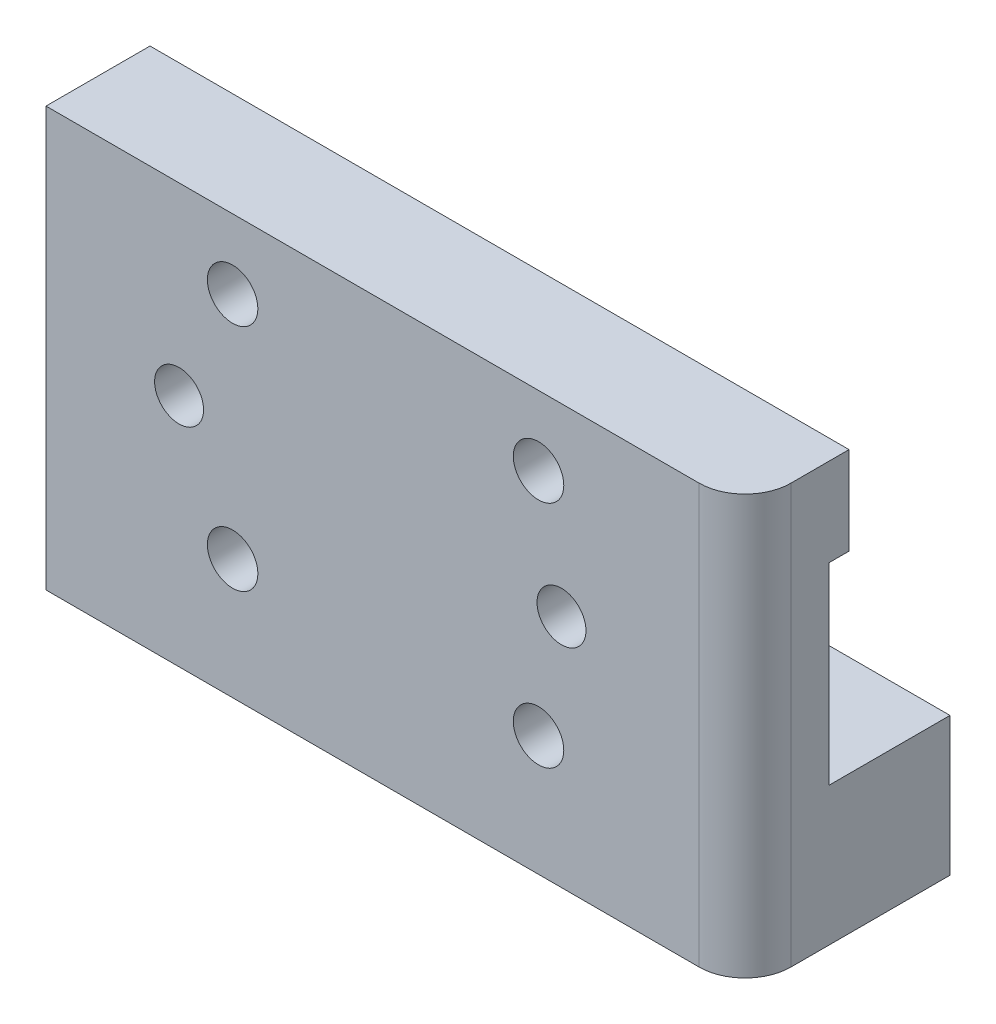
ISO-10303-21;
HEADER;
FILE_DESCRIPTION(('STEP AP214'),'2;1');
FILE_NAME('part.step','',(''),(''),'','','');
FILE_SCHEMA(('AUTOMOTIVE_DESIGN { 1 0 10303 214 1 1 1 1 }'));
ENDSEC;
DATA;
#1=APPLICATION_CONTEXT('core data for automotive mechanical design processes');
#2=APPLICATION_PROTOCOL_DEFINITION('international standard','automotive_design',2000,#1);
#3=PRODUCT_CONTEXT('',#1,'mechanical');
#4=PRODUCT('Part','Part','',(#3));
#5=PRODUCT_RELATED_PRODUCT_CATEGORY('part','',(#4));
#6=PRODUCT_DEFINITION_FORMATION('','',#4);
#7=PRODUCT_DEFINITION_CONTEXT('part definition',#1,'design');
#8=PRODUCT_DEFINITION('design','',#6,#7);
#9=PRODUCT_DEFINITION_SHAPE('','',#8);
#10=(LENGTH_UNIT() NAMED_UNIT(*) SI_UNIT(.MILLI.,.METRE.));
#11=(NAMED_UNIT(*) PLANE_ANGLE_UNIT() SI_UNIT($,.RADIAN.));
#12=(NAMED_UNIT(*) SI_UNIT($,.STERADIAN.) SOLID_ANGLE_UNIT());
#13=UNCERTAINTY_MEASURE_WITH_UNIT(LENGTH_MEASURE(1.E-05),#10,'distance_accuracy_value','');
#14=(GEOMETRIC_REPRESENTATION_CONTEXT(3) GLOBAL_UNCERTAINTY_ASSIGNED_CONTEXT((#13)) GLOBAL_UNIT_ASSIGNED_CONTEXT((#10,
#11,#12)) REPRESENTATION_CONTEXT('',''));
#15=CARTESIAN_POINT('',(0.,0.,0.));
#16=DIRECTION('',(0.,0.,1.));
#17=DIRECTION('',(1.,0.,0.));
#18=AXIS2_PLACEMENT_3D('',#15,#16,#17);
#19=CARTESIAN_POINT('',(-73.1500000000054,-7.84999999999656,1.4));
#20=DIRECTION('',(0.,0.,-1.));
#21=DIRECTION('',(-1.,0.,0.));
#22=AXIS2_PLACEMENT_3D('',#19,#20,#21);
#23=CYLINDRICAL_SURFACE('',#22,1.6499999999999);
#24=CARTESIAN_POINT('',(-73.1500000000054,-7.84999999999656,0.1));
#25=DIRECTION('',(0.,0.,1.));
#26=DIRECTION('',(1.,0.,0.));
#27=AXIS2_PLACEMENT_3D('',#24,#25,#26);
#28=CIRCLE('',#27,1.6499999999999);
#29=CARTESIAN_POINT('',(-72.0175248347155,-9.04999999999708,0.1));
#30=VERTEX_POINT('',#29);
#31=CARTESIAN_POINT('',(-74.2824751652953,-9.04999999999708,0.1));
#32=VERTEX_POINT('',#31);
#33=EDGE_CURVE('E259',#30,#32,#28,.T.);
#34=ORIENTED_EDGE('',*,*,#33,.F.);
#35=DIRECTION('',(0.,0.,-1.));
#36=VECTOR('',#35,1.);
#37=CARTESIAN_POINT('',(-72.0175248347155,-9.04999999999708,1.4));
#38=LINE('',#37,#36);
#39=CARTESIAN_POINT('',(-72.0175248347155,-9.04999999999708,1.4));
#40=VERTEX_POINT('',#39);
#41=EDGE_CURVE('E298',#40,#30,#38,.T.);
#42=ORIENTED_EDGE('',*,*,#41,.F.);
#43=CARTESIAN_POINT('',(-73.1500000000054,-7.84999999999656,1.4));
#44=DIRECTION('',(0.,0.,1.));
#45=DIRECTION('',(1.,0.,0.));
#46=AXIS2_PLACEMENT_3D('',#43,#44,#45);
#47=CIRCLE('',#46,1.6499999999999);
#48=CARTESIAN_POINT('',(-74.2824751652953,-9.04999999999708,1.4));
#49=VERTEX_POINT('',#48);
#50=EDGE_CURVE('E229',#49,#40,#47,.T.);
#51=ORIENTED_EDGE('',*,*,#50,.F.);
#52=DIRECTION('',(0.,0.,-1.));
#53=VECTOR('',#52,1.);
#54=CARTESIAN_POINT('',(-74.2824751652953,-9.04999999999708,1.4));
#55=LINE('',#54,#53);
#56=EDGE_CURVE('E283',#49,#32,#55,.T.);
#57=ORIENTED_EDGE('',*,*,#56,.T.);
#58=EDGE_LOOP('',(#34,#42,#51,#57));
#59=FACE_BOUND('',#58,.T.);
#60=CARTESIAN_POINT('',(-73.1500000000054,-7.84999999999656,6.9));
#61=DIRECTION('',(0.,0.,1.));
#62=DIRECTION('',(1.,0.,0.));
#63=AXIS2_PLACEMENT_3D('',#60,#61,#62);
#64=CIRCLE('',#63,1.6499999999999);
#65=CARTESIAN_POINT('',(-71.5000000000055,-7.84999999999656,6.9));
#66=VERTEX_POINT('',#65);
#67=EDGE_CURVE('E231',#66,#66,#64,.T.);
#68=ORIENTED_EDGE('',*,*,#67,.T.);
#69=EDGE_LOOP('',(#68));
#70=FACE_BOUND('',#69,.T.);
#71=ADVANCED_FACE('F38',(#59,#70),#23,.F.);
#72=CARTESIAN_POINT('',(0.,-9.04999999999708,1.4));
#73=DIRECTION('',(0.,1.,0.));
#74=DIRECTION('',(-1.,0.,0.));
#75=AXIS2_PLACEMENT_3D('',#72,#73,#74);
#76=PLANE('',#75);
#77=DIRECTION('',(1.,0.,0.));
#78=VECTOR('',#77,1.);
#79=CARTESIAN_POINT('',(0.,-9.04999999999708,0.1));
#80=LINE('',#79,#78);
#81=CARTESIAN_POINT('',(-59.6500000000066,-9.04999999999708,0.1));
#82=VERTEX_POINT('',#81);
#83=EDGE_CURVE('E268',#30,#82,#80,.T.);
#84=ORIENTED_EDGE('',*,*,#83,.T.);
#85=DIRECTION('',(0.,0.,-1.));
#86=VECTOR('',#85,1.);
#87=CARTESIAN_POINT('',(-59.6500000000066,-9.04999999999708,1.4));
#88=LINE('',#87,#86);
#89=CARTESIAN_POINT('',(-59.6500000000066,-9.04999999999708,1.4));
#90=VERTEX_POINT('',#89);
#91=EDGE_CURVE('E295',#90,#82,#88,.T.);
#92=ORIENTED_EDGE('',*,*,#91,.F.);
#93=DIRECTION('',(1.,0.,0.));
#94=VECTOR('',#93,1.);
#95=CARTESIAN_POINT('',(0.,-9.04999999999708,1.4));
#96=LINE('',#95,#94);
#97=EDGE_CURVE('E260',#40,#90,#96,.T.);
#98=ORIENTED_EDGE('',*,*,#97,.F.);
#99=ORIENTED_EDGE('',*,*,#41,.T.);
#100=EDGE_LOOP('',(#84,#92,#98,#99));
#101=FACE_BOUND('',#100,.T.);
#102=ADVANCED_FACE('F329',(#101),#76,.F.);
#103=CARTESIAN_POINT('',(-59.6500000000065,3.59917409885632E-13,1.4));
#104=DIRECTION('',(-1.,0.,0.));
#105=DIRECTION('',(0.,-1.,0.));
#106=AXIS2_PLACEMENT_3D('',#103,#104,#105);
#107=PLANE('',#106);
#108=DIRECTION('',(0.,0.,-1.));
#109=VECTOR('',#108,1.);
#110=CARTESIAN_POINT('',(-59.6500000000066,-3.30000000000215,1.4));
#111=LINE('',#110,#109);
#112=CARTESIAN_POINT('',(-59.6500000000066,-3.30000000000215,3.9));
#113=VERTEX_POINT('',#112);
#114=CARTESIAN_POINT('',(-59.6500000000066,-3.30000000000215,0.1));
#115=VERTEX_POINT('',#114);
#116=EDGE_CURVE('E293',#113,#115,#111,.T.);
#117=ORIENTED_EDGE('',*,*,#116,.F.);
#118=DIRECTION('',(0.,1.,0.));
#119=VECTOR('',#118,1.);
#120=CARTESIAN_POINT('',(-59.6500000000067,-30.7000000000023,3.9));
#121=LINE('',#120,#119);
#122=CARTESIAN_POINT('',(-59.6500000000064,-30.7000000000023,3.9));
#123=VERTEX_POINT('',#122);
#124=EDGE_CURVE('E46',#113,#123,#121,.F.);
#125=ORIENTED_EDGE('',*,*,#124,.T.);
#126=DIRECTION('',(0.,0.,-1.));
#127=VECTOR('',#126,1.);
#128=CARTESIAN_POINT('',(-59.6500000000064,-30.7000000000023,6.9));
#129=LINE('',#128,#127);
#130=CARTESIAN_POINT('',(-59.6500000000064,-30.7000000000023,-6.49999999999786));
#131=VERTEX_POINT('',#130);
#132=EDGE_CURVE('E252',#123,#131,#129,.T.);
#133=ORIENTED_EDGE('',*,*,#132,.T.);
#134=DIRECTION('',(0.,1.,0.));
#135=VECTOR('',#134,1.);
#136=CARTESIAN_POINT('',(-59.6500000000064,0.,-6.49999999999786));
#137=LINE('',#136,#135);
#138=CARTESIAN_POINT('',(-59.6500000000064,-21.6499999999971,-6.49999999999786));
#139=VERTEX_POINT('',#138);
#140=EDGE_CURVE('E195',#131,#139,#137,.T.);
#141=ORIENTED_EDGE('',*,*,#140,.T.);
#142=DIRECTION('',(0.,0.,-1.));
#143=VECTOR('',#142,1.);
#144=CARTESIAN_POINT('',(-59.6500000000064,-21.6499999999971,1.4));
#145=LINE('',#144,#143);
#146=CARTESIAN_POINT('',(-59.6500000000064,-21.6499999999971,1.4));
#147=VERTEX_POINT('',#146);
#148=EDGE_CURVE('E203',#147,#139,#145,.T.);
#149=ORIENTED_EDGE('',*,*,#148,.F.);
#150=DIRECTION('',(0.,1.,0.));
#151=VECTOR('',#150,1.);
#152=CARTESIAN_POINT('',(-59.6500000000064,-3.30000000000215,1.4));
#153=LINE('',#152,#151);
#154=EDGE_CURVE('E247',#147,#90,#153,.T.);
#155=ORIENTED_EDGE('',*,*,#154,.T.);
#156=ORIENTED_EDGE('',*,*,#91,.T.);
#157=DIRECTION('',(0.,1.,0.));
#158=VECTOR('',#157,1.);
#159=CARTESIAN_POINT('',(-59.6500000000065,3.59917409885632E-13,0.1));
#160=LINE('',#159,#158);
#161=EDGE_CURVE('E270',#82,#115,#160,.T.);
#162=ORIENTED_EDGE('',*,*,#161,.T.);
#163=EDGE_LOOP('',(#117,#125,#133,#141,#149,#155,#156,#162));
#164=FACE_BOUND('',#163,.T.);
#165=ADVANCED_FACE('F334',(#164),#107,.F.);
#166=CARTESIAN_POINT('',(0.,-3.30000000000215,1.4));
#167=DIRECTION('',(0.,1.,0.));
#168=DIRECTION('',(-1.,0.,0.));
#169=AXIS2_PLACEMENT_3D('',#166,#167,#168);
#170=PLANE('',#169);
#171=DIRECTION('',(-1.,0.,0.));
#172=VECTOR('',#171,1.);
#173=CARTESIAN_POINT('',(-105.350000000007,-3.30000000000215,6.9));
#174=LINE('',#173,#172);
#175=CARTESIAN_POINT('',(-62.6500000000066,-3.30000000000215,6.9));
#176=VERTEX_POINT('',#175);
#177=CARTESIAN_POINT('',(-105.350000000007,-3.30000000000215,6.9));
#178=VERTEX_POINT('',#177);
#179=EDGE_CURVE('E250',#176,#178,#174,.T.);
#180=ORIENTED_EDGE('',*,*,#179,.F.);
#181=CARTESIAN_POINT('',(-62.6500000000066,-3.30000000000215,3.9));
#182=DIRECTION('',(0.,1.,0.));
#183=DIRECTION('',(-1.,0.,0.));
#184=AXIS2_PLACEMENT_3D('',#181,#182,#183);
#185=CIRCLE('',#184,3.);
#186=EDGE_CURVE('E60',#176,#113,#185,.T.);
#187=ORIENTED_EDGE('',*,*,#186,.T.);
#188=ORIENTED_EDGE('',*,*,#116,.T.);
#189=DIRECTION('',(1.,0.,0.));
#190=VECTOR('',#189,1.);
#191=CARTESIAN_POINT('',(0.,-3.30000000000215,0.1));
#192=LINE('',#191,#190);
#193=CARTESIAN_POINT('',(-105.350000000007,-3.30000000000215,0.1));
#194=VERTEX_POINT('',#193);
#195=EDGE_CURVE('E274',#194,#115,#192,.T.);
#196=ORIENTED_EDGE('',*,*,#195,.F.);
#197=DIRECTION('',(0.,0.,-1.));
#198=VECTOR('',#197,1.);
#199=CARTESIAN_POINT('',(-105.350000000007,-3.30000000000215,1.4));
#200=LINE('',#199,#198);
#201=EDGE_CURVE('E291',#178,#194,#200,.T.);
#202=ORIENTED_EDGE('',*,*,#201,.F.);
#203=EDGE_LOOP('',(#180,#187,#188,#196,#202));
#204=FACE_BOUND('',#203,.T.);
#205=ADVANCED_FACE('F310',(#204),#170,.T.);
#206=CARTESIAN_POINT('',(-105.350000000007,0.,1.4));
#207=DIRECTION('',(-1.,0.,0.));
#208=DIRECTION('',(0.,0.,1.));
#209=AXIS2_PLACEMENT_3D('',#206,#207,#208);
#210=PLANE('',#209);
#211=DIRECTION('',(0.,1.,0.));
#212=VECTOR('',#211,1.);
#213=CARTESIAN_POINT('',(-105.350000000007,0.,0.1));
#214=LINE('',#213,#212);
#215=CARTESIAN_POINT('',(-105.350000000007,-9.04999999999708,0.1));
#216=VERTEX_POINT('',#215);
#217=EDGE_CURVE('E277',#216,#194,#214,.T.);
#218=ORIENTED_EDGE('',*,*,#217,.F.);
#219=DIRECTION('',(0.,0.,-1.));
#220=VECTOR('',#219,1.);
#221=CARTESIAN_POINT('',(-105.350000000007,-9.04999999999708,1.4));
#222=LINE('',#221,#220);
#223=CARTESIAN_POINT('',(-105.350000000007,-9.04999999999708,1.4));
#224=VERTEX_POINT('',#223);
#225=EDGE_CURVE('E289',#224,#216,#222,.T.);
#226=ORIENTED_EDGE('',*,*,#225,.F.);
#227=DIRECTION('',(0.,-1.,0.));
#228=VECTOR('',#227,1.);
#229=CARTESIAN_POINT('',(-105.350000000007,-3.30000000000215,1.4));
#230=LINE('',#229,#228);
#231=CARTESIAN_POINT('',(-105.350000000007,-21.6499999999971,1.4));
#232=VERTEX_POINT('',#231);
#233=EDGE_CURVE('E240',#224,#232,#230,.T.);
#234=ORIENTED_EDGE('',*,*,#233,.T.);
#235=DIRECTION('',(0.,0.,-1.));
#236=VECTOR('',#235,1.);
#237=CARTESIAN_POINT('',(-105.350000000007,-21.6499999999971,1.4));
#238=LINE('',#237,#236);
#239=CARTESIAN_POINT('',(-105.350000000007,-21.6499999999971,-6.49999999999786));
#240=VERTEX_POINT('',#239);
#241=EDGE_CURVE('E205',#232,#240,#238,.T.);
#242=ORIENTED_EDGE('',*,*,#241,.T.);
#243=DIRECTION('',(0.,1.,0.));
#244=VECTOR('',#243,1.);
#245=CARTESIAN_POINT('',(-105.350000000007,0.,-6.49999999999786));
#246=LINE('',#245,#244);
#247=CARTESIAN_POINT('',(-105.350000000007,-30.7000000000023,-6.49999999999786));
#248=VERTEX_POINT('',#247);
#249=EDGE_CURVE('E188',#248,#240,#246,.T.);
#250=ORIENTED_EDGE('',*,*,#249,.F.);
#251=DIRECTION('',(0.,0.,-1.));
#252=VECTOR('',#251,1.);
#253=CARTESIAN_POINT('',(-105.350000000007,-30.7000000000023,6.9));
#254=LINE('',#253,#252);
#255=CARTESIAN_POINT('',(-105.350000000007,-30.7000000000023,6.9));
#256=VERTEX_POINT('',#255);
#257=EDGE_CURVE('E257',#256,#248,#254,.T.);
#258=ORIENTED_EDGE('',*,*,#257,.F.);
#259=DIRECTION('',(0.,-1.,0.));
#260=VECTOR('',#259,1.);
#261=CARTESIAN_POINT('',(-105.350000000007,-3.30000000000215,6.9));
#262=LINE('',#261,#260);
#263=EDGE_CURVE('E243',#178,#256,#262,.T.);
#264=ORIENTED_EDGE('',*,*,#263,.F.);
#265=ORIENTED_EDGE('',*,*,#201,.T.);
#266=EDGE_LOOP('',(#218,#226,#234,#242,#250,#258,#264,#265));
#267=FACE_BOUND('',#266,.T.);
#268=ADVANCED_FACE('F316',(#267),#210,.T.);
#269=CARTESIAN_POINT('',(-94.2824751652872,-9.04999999999708,0.1));
#270=VERTEX_POINT('',#269);
#271=EDGE_CURVE('E271',#216,#270,#80,.T.);
#272=ORIENTED_EDGE('',*,*,#271,.T.);
#273=DIRECTION('',(0.,0.,-1.));
#274=VECTOR('',#273,1.);
#275=CARTESIAN_POINT('',(-94.2824751652872,-9.04999999999708,1.4));
#276=LINE('',#275,#274);
#277=CARTESIAN_POINT('',(-94.2824751652872,-9.04999999999708,1.4));
#278=VERTEX_POINT('',#277);
#279=EDGE_CURVE('E287',#278,#270,#276,.T.);
#280=ORIENTED_EDGE('',*,*,#279,.F.);
#281=EDGE_CURVE('E263',#224,#278,#96,.T.);
#282=ORIENTED_EDGE('',*,*,#281,.F.);
#283=ORIENTED_EDGE('',*,*,#225,.T.);
#284=EDGE_LOOP('',(#272,#280,#282,#283));
#285=FACE_BOUND('',#284,.T.);
#286=ADVANCED_FACE('F337',(#285),#76,.F.);
#287=CARTESIAN_POINT('',(-93.1500000000054,-7.84999999999657,1.4));
#288=DIRECTION('',(0.,0.,-1.));
#289=DIRECTION('',(-1.,0.,0.));
#290=AXIS2_PLACEMENT_3D('',#287,#288,#289);
#291=CYLINDRICAL_SURFACE('',#290,1.64999999999434);
#292=CARTESIAN_POINT('',(-93.1500000000054,-7.84999999999657,0.1));
#293=DIRECTION('',(0.,0.,1.));
#294=DIRECTION('',(1.,0.,0.));
#295=AXIS2_PLACEMENT_3D('',#292,#293,#294);
#296=CIRCLE('',#295,1.64999999999434);
#297=CARTESIAN_POINT('',(-92.0175248347236,-9.04999999999708,0.1));
#298=VERTEX_POINT('',#297);
#299=EDGE_CURVE('E280',#298,#270,#296,.T.);
#300=ORIENTED_EDGE('',*,*,#299,.F.);
#301=DIRECTION('',(0.,0.,-1.));
#302=VECTOR('',#301,1.);
#303=CARTESIAN_POINT('',(-92.0175248347236,-9.04999999999708,1.4));
#304=LINE('',#303,#302);
#305=CARTESIAN_POINT('',(-92.0175248347236,-9.04999999999708,1.4));
#306=VERTEX_POINT('',#305);
#307=EDGE_CURVE('E285',#306,#298,#304,.T.);
#308=ORIENTED_EDGE('',*,*,#307,.F.);
#309=CARTESIAN_POINT('',(-93.1500000000054,-7.84999999999657,1.4));
#310=DIRECTION('',(0.,0.,1.));
#311=DIRECTION('',(1.,0.,0.));
#312=AXIS2_PLACEMENT_3D('',#309,#310,#311);
#313=CIRCLE('',#312,1.64999999999434);
#314=EDGE_CURVE('E234',#278,#306,#313,.T.);
#315=ORIENTED_EDGE('',*,*,#314,.F.);
#316=ORIENTED_EDGE('',*,*,#279,.T.);
#317=EDGE_LOOP('',(#300,#308,#315,#316));
#318=FACE_BOUND('',#317,.T.);
#319=CARTESIAN_POINT('',(-93.1500000000054,-7.84999999999657,6.9));
#320=DIRECTION('',(0.,0.,1.));
#321=DIRECTION('',(1.,0.,0.));
#322=AXIS2_PLACEMENT_3D('',#319,#320,#321);
#323=CIRCLE('',#322,1.64999999999434);
#324=CARTESIAN_POINT('',(-91.5000000000111,-7.84999999999657,6.9));
#325=VERTEX_POINT('',#324);
#326=EDGE_CURVE('E237',#325,#325,#323,.T.);
#327=ORIENTED_EDGE('',*,*,#326,.T.);
#328=EDGE_LOOP('',(#327));
#329=FACE_BOUND('',#328,.T.);
#330=ADVANCED_FACE('F348',(#318,#329),#291,.F.);
#331=EDGE_CURVE('E264',#298,#32,#80,.T.);
#332=ORIENTED_EDGE('',*,*,#331,.T.);
#333=ORIENTED_EDGE('',*,*,#56,.F.);
#334=EDGE_CURVE('E265',#306,#49,#96,.T.);
#335=ORIENTED_EDGE('',*,*,#334,.F.);
#336=ORIENTED_EDGE('',*,*,#307,.T.);
#337=EDGE_LOOP('',(#332,#333,#335,#336));
#338=FACE_BOUND('',#337,.T.);
#339=ADVANCED_FACE('F338',(#338),#76,.F.);
#340=CARTESIAN_POINT('',(0.,0.,0.1));
#341=DIRECTION('',(0.,0.,1.));
#342=DIRECTION('',(1.,0.,0.));
#343=AXIS2_PLACEMENT_3D('',#340,#341,#342);
#344=PLANE('',#343);
#345=ORIENTED_EDGE('',*,*,#33,.T.);
#346=ORIENTED_EDGE('',*,*,#331,.F.);
#347=ORIENTED_EDGE('',*,*,#299,.T.);
#348=ORIENTED_EDGE('',*,*,#271,.F.);
#349=ORIENTED_EDGE('',*,*,#217,.T.);
#350=ORIENTED_EDGE('',*,*,#195,.T.);
#351=ORIENTED_EDGE('',*,*,#161,.F.);
#352=ORIENTED_EDGE('',*,*,#83,.F.);
#353=EDGE_LOOP('',(#345,#346,#347,#348,#349,#350,#351,#352));
#354=FACE_BOUND('',#353,.T.);
#355=ADVANCED_FACE('F353',(#354),#344,.F.);
#356=CARTESIAN_POINT('',(0.,0.,1.4));
#357=DIRECTION('',(0.,0.,1.));
#358=DIRECTION('',(1.,0.,0.));
#359=AXIS2_PLACEMENT_3D('',#356,#357,#358);
#360=PLANE('',#359);
#361=CARTESIAN_POINT('',(-73.1500000000063,-22.8499864669187,1.4));
#362=DIRECTION('',(0.,0.,1.));
#363=DIRECTION('',(1.,0.,0.));
#364=AXIS2_PLACEMENT_3D('',#361,#362,#363);
#365=CIRCLE('',#364,1.65);
#366=CARTESIAN_POINT('',(-72.0175104948872,-21.6499999999971,1.4));
#367=VERTEX_POINT('',#366);
#368=CARTESIAN_POINT('',(-74.2824895051254,-21.6499999999971,1.4));
#369=VERTEX_POINT('',#368);
#370=EDGE_CURVE('E219',#367,#369,#365,.T.);
#371=ORIENTED_EDGE('',*,*,#370,.T.);
#372=DIRECTION('',(1.,0.,0.));
#373=VECTOR('',#372,1.);
#374=CARTESIAN_POINT('',(0.,-21.6499999999971,1.4));
#375=LINE('',#374,#373);
#376=CARTESIAN_POINT('',(-92.01751049489,-21.6499999999971,1.4));
#377=VERTEX_POINT('',#376);
#378=EDGE_CURVE('E183',#377,#369,#375,.T.);
#379=ORIENTED_EDGE('',*,*,#378,.F.);
#380=CARTESIAN_POINT('',(-93.1500000000089,-22.8499864669189,1.4));
#381=DIRECTION('',(0.,0.,1.));
#382=DIRECTION('',(1.,0.,0.));
#383=AXIS2_PLACEMENT_3D('',#380,#381,#382);
#384=CIRCLE('',#383,1.65);
#385=CARTESIAN_POINT('',(-94.2824895051278,-21.6499999999971,1.4));
#386=VERTEX_POINT('',#385);
#387=EDGE_CURVE('E163',#377,#386,#384,.T.);
#388=ORIENTED_EDGE('',*,*,#387,.T.);
#389=EDGE_CURVE('E185',#232,#386,#375,.T.);
#390=ORIENTED_EDGE('',*,*,#389,.F.);
#391=ORIENTED_EDGE('',*,*,#233,.F.);
#392=ORIENTED_EDGE('',*,*,#281,.T.);
#393=ORIENTED_EDGE('',*,*,#314,.T.);
#394=ORIENTED_EDGE('',*,*,#334,.T.);
#395=ORIENTED_EDGE('',*,*,#50,.T.);
#396=ORIENTED_EDGE('',*,*,#97,.T.);
#397=ORIENTED_EDGE('',*,*,#154,.F.);
#398=EDGE_CURVE('E187',#367,#147,#375,.T.);
#399=ORIENTED_EDGE('',*,*,#398,.F.);
#400=EDGE_LOOP('',(#371,#379,#388,#390,#391,#392,#393,#394,#395,#396,#397,#399));
#401=FACE_BOUND('',#400,.T.);
#402=CARTESIAN_POINT('',(-96.6500000000586,-15.3499999999947,1.4));
#403=DIRECTION('',(0.,0.,1.));
#404=DIRECTION('',(1.,0.,0.));
#405=AXIS2_PLACEMENT_3D('',#402,#403,#404);
#406=CIRCLE('',#405,1.60000000000178);
#407=CARTESIAN_POINT('',(-95.0500000000568,-15.3499999999947,1.4));
#408=VERTEX_POINT('',#407);
#409=EDGE_CURVE('E213',#408,#408,#406,.T.);
#410=ORIENTED_EDGE('',*,*,#409,.T.);
#411=EDGE_LOOP('',(#410));
#412=FACE_BOUND('',#411,.T.);
#413=CARTESIAN_POINT('',(-71.6500000000585,-15.3499999999947,1.4));
#414=DIRECTION('',(0.,0.,1.));
#415=DIRECTION('',(1.,0.,0.));
#416=AXIS2_PLACEMENT_3D('',#413,#414,#415);
#417=CIRCLE('',#416,1.60000000000178);
#418=CARTESIAN_POINT('',(-70.0500000000567,-15.3499999999947,1.4));
#419=VERTEX_POINT('',#418);
#420=EDGE_CURVE('E209',#419,#419,#417,.T.);
#421=ORIENTED_EDGE('',*,*,#420,.T.);
#422=EDGE_LOOP('',(#421));
#423=FACE_BOUND('',#422,.T.);
#424=ADVANCED_FACE('F357',(#401,#412,#423),#360,.F.);
#425=CARTESIAN_POINT('',(0.,0.,6.9));
#426=DIRECTION('',(0.,0.,1.));
#427=DIRECTION('',(1.,0.,0.));
#428=AXIS2_PLACEMENT_3D('',#425,#426,#427);
#429=PLANE('',#428);
#430=CARTESIAN_POINT('',(-96.6500000000586,-15.3499999999947,6.9));
#431=DIRECTION('',(0.,0.,1.));
#432=DIRECTION('',(1.,0.,0.));
#433=AXIS2_PLACEMENT_3D('',#430,#431,#432);
#434=CIRCLE('',#433,1.60000000000178);
#435=CARTESIAN_POINT('',(-95.0500000000568,-15.3499999999947,6.9));
#436=VERTEX_POINT('',#435);
#437=EDGE_CURVE('E216',#436,#436,#434,.T.);
#438=ORIENTED_EDGE('',*,*,#437,.F.);
#439=EDGE_LOOP('',(#438));
#440=FACE_BOUND('',#439,.T.);
#441=CARTESIAN_POINT('',(-93.1500000000089,-22.8499864669189,6.9));
#442=DIRECTION('',(0.,0.,1.));
#443=DIRECTION('',(1.,0.,0.));
#444=AXIS2_PLACEMENT_3D('',#441,#442,#443);
#445=CIRCLE('',#444,1.65);
#446=CARTESIAN_POINT('',(-91.5000000000089,-22.8499864669189,6.9));
#447=VERTEX_POINT('',#446);
#448=EDGE_CURVE('E226',#447,#447,#445,.T.);
#449=ORIENTED_EDGE('',*,*,#448,.F.);
#450=EDGE_LOOP('',(#449));
#451=FACE_BOUND('',#450,.T.);
#452=ORIENTED_EDGE('',*,*,#326,.F.);
#453=EDGE_LOOP('',(#452));
#454=FACE_BOUND('',#453,.T.);
#455=DIRECTION('',(1.,0.,0.));
#456=VECTOR('',#455,1.);
#457=CARTESIAN_POINT('',(-105.350000000007,-30.7000000000023,6.9));
#458=LINE('',#457,#456);
#459=CARTESIAN_POINT('',(-62.6500000000067,-30.7000000000023,6.9));
#460=VERTEX_POINT('',#459);
#461=EDGE_CURVE('E246',#256,#460,#458,.T.);
#462=ORIENTED_EDGE('',*,*,#461,.T.);
#463=DIRECTION('',(0.,1.,0.));
#464=VECTOR('',#463,1.);
#465=CARTESIAN_POINT('',(-62.6500000000066,-3.30000000000213,6.9));
#466=LINE('',#465,#464);
#467=EDGE_CURVE('E300',#460,#176,#466,.T.);
#468=ORIENTED_EDGE('',*,*,#467,.T.);
#469=ORIENTED_EDGE('',*,*,#179,.T.);
#470=ORIENTED_EDGE('',*,*,#263,.T.);
#471=EDGE_LOOP('',(#462,#468,#469,#470));
#472=FACE_BOUND('',#471,.T.);
#473=ORIENTED_EDGE('',*,*,#67,.F.);
#474=EDGE_LOOP('',(#473));
#475=FACE_BOUND('',#474,.T.);
#476=CARTESIAN_POINT('',(-73.1500000000063,-22.8499864669187,6.9));
#477=DIRECTION('',(0.,0.,1.));
#478=DIRECTION('',(1.,0.,0.));
#479=AXIS2_PLACEMENT_3D('',#476,#477,#478);
#480=CIRCLE('',#479,1.65);
#481=CARTESIAN_POINT('',(-71.5000000000063,-22.8499864669187,6.9));
#482=VERTEX_POINT('',#481);
#483=EDGE_CURVE('E222',#482,#482,#480,.T.);
#484=ORIENTED_EDGE('',*,*,#483,.F.);
#485=EDGE_LOOP('',(#484));
#486=FACE_BOUND('',#485,.T.);
#487=CARTESIAN_POINT('',(-71.6500000000585,-15.3499999999947,6.9));
#488=DIRECTION('',(0.,0.,1.));
#489=DIRECTION('',(1.,0.,0.));
#490=AXIS2_PLACEMENT_3D('',#487,#488,#489);
#491=CIRCLE('',#490,1.60000000000178);
#492=CARTESIAN_POINT('',(-70.0500000000567,-15.3499999999947,6.9));
#493=VERTEX_POINT('',#492);
#494=EDGE_CURVE('E210',#493,#493,#491,.T.);
#495=ORIENTED_EDGE('',*,*,#494,.F.);
#496=EDGE_LOOP('',(#495));
#497=FACE_BOUND('',#496,.T.);
#498=ADVANCED_FACE('F305',(#440,#451,#454,#472,#475,#486,#497),#429,.T.);
#499=CARTESIAN_POINT('',(-105.350000000007,-30.7000000000023,6.9));
#500=DIRECTION('',(0.,1.,0.));
#501=DIRECTION('',(0.,0.,1.));
#502=AXIS2_PLACEMENT_3D('',#499,#500,#501);
#503=PLANE('',#502);
#504=ORIENTED_EDGE('',*,*,#132,.F.);
#505=CARTESIAN_POINT('',(-62.6500000000067,-30.7000000000023,3.9));
#506=DIRECTION('',(0.,1.,0.));
#507=DIRECTION('',(0.,0.,1.));
#508=AXIS2_PLACEMENT_3D('',#505,#506,#507);
#509=CIRCLE('',#508,3.);
#510=EDGE_CURVE('E12',#123,#460,#509,.F.);
#511=ORIENTED_EDGE('',*,*,#510,.T.);
#512=ORIENTED_EDGE('',*,*,#461,.F.);
#513=ORIENTED_EDGE('',*,*,#257,.T.);
#514=DIRECTION('',(1.,0.,0.));
#515=VECTOR('',#514,1.);
#516=CARTESIAN_POINT('',(0.,-30.7000000000023,-6.49999999999786));
#517=LINE('',#516,#515);
#518=EDGE_CURVE('E177',#248,#131,#517,.T.);
#519=ORIENTED_EDGE('',*,*,#518,.T.);
#520=EDGE_LOOP('',(#504,#511,#512,#513,#519));
#521=FACE_BOUND('',#520,.T.);
#522=ADVANCED_FACE('F320',(#521),#503,.F.);
#523=CARTESIAN_POINT('',(-93.1500000000089,-22.8499864669189,6.9));
#524=DIRECTION('',(0.,0.,-1.));
#525=DIRECTION('',(-1.,0.,0.));
#526=AXIS2_PLACEMENT_3D('',#523,#524,#525);
#527=CYLINDRICAL_SURFACE('',#526,1.65);
#528=ORIENTED_EDGE('',*,*,#448,.T.);
#529=EDGE_LOOP('',(#528));
#530=FACE_BOUND('',#529,.T.);
#531=ORIENTED_EDGE('',*,*,#387,.F.);
#532=DIRECTION('',(0.,0.,-1.));
#533=VECTOR('',#532,1.);
#534=CARTESIAN_POINT('',(-92.01751049489,-21.6499999999971,1.4));
#535=LINE('',#534,#533);
#536=CARTESIAN_POINT('',(-92.01751049489,-21.6499999999971,-6.49999999999786));
#537=VERTEX_POINT('',#536);
#538=EDGE_CURVE('E156',#377,#537,#535,.T.);
#539=ORIENTED_EDGE('',*,*,#538,.T.);
#540=CARTESIAN_POINT('',(-93.1500000000089,-22.8499864669189,-6.49999999999786));
#541=DIRECTION('',(0.,0.,-1.));
#542=DIRECTION('',(-1.,0.,0.));
#543=AXIS2_PLACEMENT_3D('',#540,#541,#542);
#544=CIRCLE('',#543,1.65);
#545=CARTESIAN_POINT('',(-94.2824895051278,-21.6499999999971,-6.49999999999786));
#546=VERTEX_POINT('',#545);
#547=EDGE_CURVE('E161',#546,#537,#544,.F.);
#548=ORIENTED_EDGE('',*,*,#547,.F.);
#549=DIRECTION('',(0.,0.,-1.));
#550=VECTOR('',#549,1.);
#551=CARTESIAN_POINT('',(-94.2824895051278,-21.6499999999971,1.4));
#552=LINE('',#551,#550);
#553=EDGE_CURVE('E167',#386,#546,#552,.T.);
#554=ORIENTED_EDGE('',*,*,#553,.F.);
#555=EDGE_LOOP('',(#531,#539,#548,#554));
#556=FACE_BOUND('',#555,.T.);
#557=ADVANCED_FACE('F158',(#530,#556),#527,.F.);
#558=CARTESIAN_POINT('',(-73.1500000000063,-22.8499864669187,6.9));
#559=DIRECTION('',(0.,0.,-1.));
#560=DIRECTION('',(-1.,0.,0.));
#561=AXIS2_PLACEMENT_3D('',#558,#559,#560);
#562=CYLINDRICAL_SURFACE('',#561,1.65);
#563=ORIENTED_EDGE('',*,*,#483,.T.);
#564=EDGE_LOOP('',(#563));
#565=FACE_BOUND('',#564,.T.);
#566=ORIENTED_EDGE('',*,*,#370,.F.);
#567=DIRECTION('',(0.,0.,-1.));
#568=VECTOR('',#567,1.);
#569=CARTESIAN_POINT('',(-72.0175104948872,-21.6499999999971,1.4));
#570=LINE('',#569,#568);
#571=CARTESIAN_POINT('',(-72.0175104948872,-21.6499999999971,-6.49999999999786));
#572=VERTEX_POINT('',#571);
#573=EDGE_CURVE('E201',#367,#572,#570,.T.);
#574=ORIENTED_EDGE('',*,*,#573,.T.);
#575=CARTESIAN_POINT('',(-73.1500000000063,-22.8499864669187,-6.49999999999786));
#576=DIRECTION('',(0.,0.,-1.));
#577=DIRECTION('',(-1.,0.,0.));
#578=AXIS2_PLACEMENT_3D('',#575,#576,#577);
#579=CIRCLE('',#578,1.65);
#580=CARTESIAN_POINT('',(-74.2824895051254,-21.6499999999971,-6.49999999999786));
#581=VERTEX_POINT('',#580);
#582=EDGE_CURVE('E176',#581,#572,#579,.F.);
#583=ORIENTED_EDGE('',*,*,#582,.F.);
#584=DIRECTION('',(0.,0.,-1.));
#585=VECTOR('',#584,1.);
#586=CARTESIAN_POINT('',(-74.2824895051254,-21.6499999999971,1.4));
#587=LINE('',#586,#585);
#588=EDGE_CURVE('E166',#369,#581,#587,.T.);
#589=ORIENTED_EDGE('',*,*,#588,.F.);
#590=EDGE_LOOP('',(#566,#574,#583,#589));
#591=FACE_BOUND('',#590,.T.);
#592=ADVANCED_FACE('F369',(#565,#591),#562,.F.);
#593=CARTESIAN_POINT('',(-96.6500000000586,-15.3499999999947,6.9));
#594=DIRECTION('',(0.,0.,-1.));
#595=DIRECTION('',(-1.,0.,0.));
#596=AXIS2_PLACEMENT_3D('',#593,#594,#595);
#597=CYLINDRICAL_SURFACE('',#596,1.60000000000178);
#598=ORIENTED_EDGE('',*,*,#437,.T.);
#599=EDGE_LOOP('',(#598));
#600=FACE_BOUND('',#599,.T.);
#601=ORIENTED_EDGE('',*,*,#409,.F.);
#602=EDGE_LOOP('',(#601));
#603=FACE_BOUND('',#602,.T.);
#604=ADVANCED_FACE('F373',(#600,#603),#597,.F.);
#605=CARTESIAN_POINT('',(-71.6500000000585,-15.3499999999947,6.9));
#606=DIRECTION('',(0.,0.,-1.));
#607=DIRECTION('',(-1.,0.,0.));
#608=AXIS2_PLACEMENT_3D('',#605,#606,#607);
#609=CYLINDRICAL_SURFACE('',#608,1.60000000000178);
#610=ORIENTED_EDGE('',*,*,#494,.T.);
#611=EDGE_LOOP('',(#610));
#612=FACE_BOUND('',#611,.T.);
#613=ORIENTED_EDGE('',*,*,#420,.F.);
#614=EDGE_LOOP('',(#613));
#615=FACE_BOUND('',#614,.T.);
#616=ADVANCED_FACE('F377',(#612,#615),#609,.F.);
#617=CARTESIAN_POINT('',(0.,-21.6499999999971,1.4));
#618=DIRECTION('',(0.,1.,0.));
#619=DIRECTION('',(0.,0.,1.));
#620=AXIS2_PLACEMENT_3D('',#617,#618,#619);
#621=PLANE('',#620);
#622=ORIENTED_EDGE('',*,*,#588,.T.);
#623=DIRECTION('',(1.,0.,0.));
#624=VECTOR('',#623,1.);
#625=CARTESIAN_POINT('',(0.,-21.6499999999971,-6.49999999999786));
#626=LINE('',#625,#624);
#627=EDGE_CURVE('E170',#537,#581,#626,.T.);
#628=ORIENTED_EDGE('',*,*,#627,.F.);
#629=ORIENTED_EDGE('',*,*,#538,.F.);
#630=ORIENTED_EDGE('',*,*,#378,.T.);
#631=EDGE_LOOP('',(#622,#628,#629,#630));
#632=FACE_BOUND('',#631,.T.);
#633=ADVANCED_FACE('F171',(#632),#621,.T.);
#634=ORIENTED_EDGE('',*,*,#553,.T.);
#635=DIRECTION('',(1.,0.,0.));
#636=VECTOR('',#635,1.);
#637=CARTESIAN_POINT('',(0.,-21.6499999999971,-6.49999999999786));
#638=LINE('',#637,#636);
#639=EDGE_CURVE('E182',#240,#546,#638,.T.);
#640=ORIENTED_EDGE('',*,*,#639,.F.);
#641=ORIENTED_EDGE('',*,*,#241,.F.);
#642=ORIENTED_EDGE('',*,*,#389,.T.);
#643=EDGE_LOOP('',(#634,#640,#641,#642));
#644=FACE_BOUND('',#643,.T.);
#645=ADVANCED_FACE('F383',(#644),#621,.T.);
#646=ORIENTED_EDGE('',*,*,#148,.T.);
#647=DIRECTION('',(1.,0.,0.));
#648=VECTOR('',#647,1.);
#649=CARTESIAN_POINT('',(0.,-21.6499999999971,-6.49999999999786));
#650=LINE('',#649,#648);
#651=EDGE_CURVE('E192',#572,#139,#650,.T.);
#652=ORIENTED_EDGE('',*,*,#651,.F.);
#653=ORIENTED_EDGE('',*,*,#573,.F.);
#654=ORIENTED_EDGE('',*,*,#398,.T.);
#655=EDGE_LOOP('',(#646,#652,#653,#654));
#656=FACE_BOUND('',#655,.T.);
#657=ADVANCED_FACE('F326',(#656),#621,.T.);
#658=CARTESIAN_POINT('',(-100.650000000007,-21.4499999999971,-6.49999999999786));
#659=DIRECTION('',(0.,0.,-1.));
#660=DIRECTION('',(0.,1.,0.));
#661=AXIS2_PLACEMENT_3D('',#658,#659,#660);
#662=PLANE('',#661);
#663=ORIENTED_EDGE('',*,*,#627,.T.);
#664=ORIENTED_EDGE('',*,*,#582,.T.);
#665=ORIENTED_EDGE('',*,*,#651,.T.);
#666=ORIENTED_EDGE('',*,*,#140,.F.);
#667=ORIENTED_EDGE('',*,*,#518,.F.);
#668=ORIENTED_EDGE('',*,*,#249,.T.);
#669=ORIENTED_EDGE('',*,*,#639,.T.);
#670=ORIENTED_EDGE('',*,*,#547,.T.);
#671=EDGE_LOOP('',(#663,#664,#665,#666,#667,#668,#669,#670));
#672=FACE_BOUND('',#671,.T.);
#673=ADVANCED_FACE('F179',(#672),#662,.T.);
#674=CARTESIAN_POINT('',(-62.6500000000065,3.78018872243667E-13,3.9));
#675=DIRECTION('',(0.,-1.,0.));
#676=DIRECTION('',(1.,0.,0.));
#677=AXIS2_PLACEMENT_3D('',#674,#675,#676);
#678=CYLINDRICAL_SURFACE('',#677,3.);
#679=ORIENTED_EDGE('',*,*,#510,.F.);
#680=ORIENTED_EDGE('',*,*,#124,.F.);
#681=ORIENTED_EDGE('',*,*,#186,.F.);
#682=ORIENTED_EDGE('',*,*,#467,.F.);
#683=EDGE_LOOP('',(#679,#680,#681,#682));
#684=FACE_BOUND('',#683,.T.);
#685=ADVANCED_FACE('F40',(#684),#678,.T.);
#686=CLOSED_SHELL('',(#71,#102,#165,#205,#268,#286,#330,#339,#355,#424,#498,#522,#557,#592,#604,
#616,#633,#645,#657,#673,#685));
#687=MANIFOLD_SOLID_BREP('B2',#686);
#688=ADVANCED_BREP_SHAPE_REPRESENTATION('',(#18,#687),#14);
#689=SHAPE_DEFINITION_REPRESENTATION(#9,#688);
ENDSEC;
END-ISO-10303-21;
